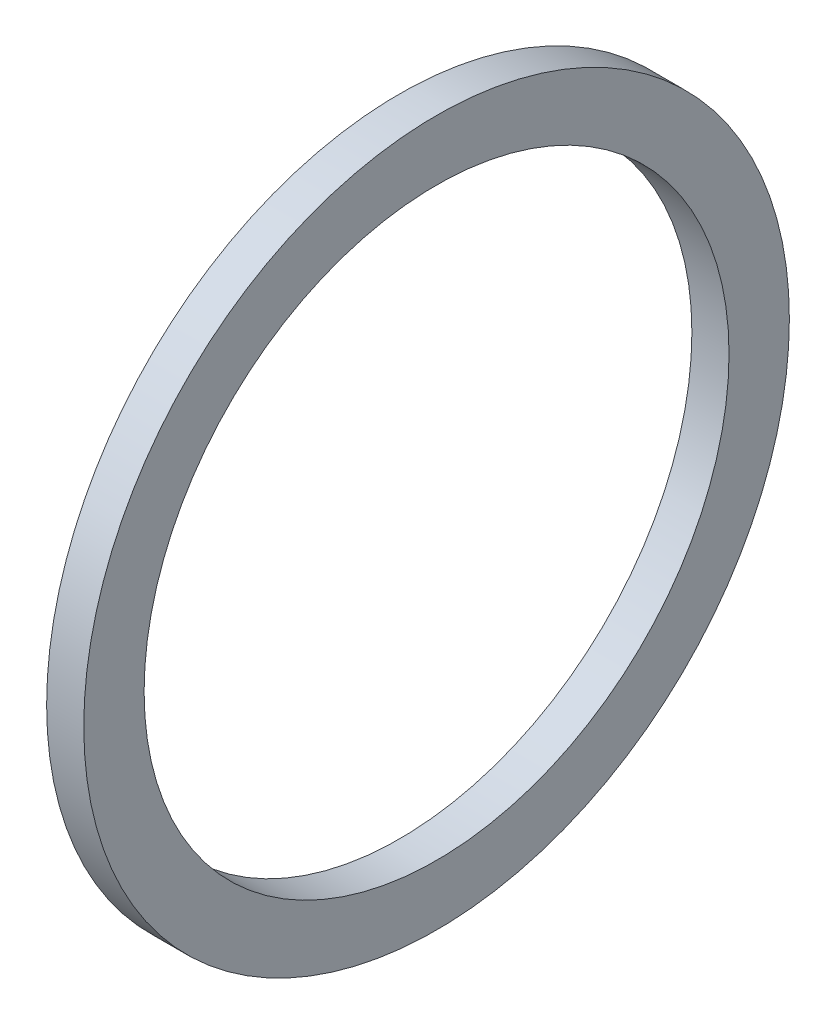
ISO-10303-21;
HEADER;
FILE_DESCRIPTION(('STEP AP214'),'2;1');
FILE_NAME('part.step','',(''),(''),'','','');
FILE_SCHEMA(('AUTOMOTIVE_DESIGN { 1 0 10303 214 1 1 1 1 }'));
ENDSEC;
DATA;
#1=APPLICATION_CONTEXT('core data for automotive mechanical design processes');
#2=APPLICATION_PROTOCOL_DEFINITION('international standard','automotive_design',2000,#1);
#3=PRODUCT_CONTEXT('',#1,'mechanical');
#4=PRODUCT('Part','Part','',(#3));
#5=PRODUCT_RELATED_PRODUCT_CATEGORY('part','',(#4));
#6=PRODUCT_DEFINITION_FORMATION('','',#4);
#7=PRODUCT_DEFINITION_CONTEXT('part definition',#1,'design');
#8=PRODUCT_DEFINITION('design','',#6,#7);
#9=PRODUCT_DEFINITION_SHAPE('','',#8);
#10=(LENGTH_UNIT() NAMED_UNIT(*) SI_UNIT(.MILLI.,.METRE.));
#11=(NAMED_UNIT(*) PLANE_ANGLE_UNIT() SI_UNIT($,.RADIAN.));
#12=(NAMED_UNIT(*) SI_UNIT($,.STERADIAN.) SOLID_ANGLE_UNIT());
#13=UNCERTAINTY_MEASURE_WITH_UNIT(LENGTH_MEASURE(1.E-05),#10,'distance_accuracy_value','');
#14=(GEOMETRIC_REPRESENTATION_CONTEXT(3) GLOBAL_UNCERTAINTY_ASSIGNED_CONTEXT((#13)) GLOBAL_UNIT_ASSIGNED_CONTEXT((#10,
#11,#12)) REPRESENTATION_CONTEXT('',''));
#15=CARTESIAN_POINT('',(0.,0.,0.));
#16=DIRECTION('',(0.,0.,1.));
#17=DIRECTION('',(1.,0.,0.));
#18=AXIS2_PLACEMENT_3D('',#15,#16,#17);
#19=CARTESIAN_POINT('',(0.,-16.002,0.));
#20=DIRECTION('',(-1.,0.,0.));
#21=DIRECTION('',(0.,0.,1.));
#22=AXIS2_PLACEMENT_3D('',#19,#20,#21);
#23=PLANE('',#22);
#24=CARTESIAN_POINT('',(0.,0.,0.));
#25=DIRECTION('',(-1.,0.,0.));
#26=DIRECTION('',(0.,0.,1.));
#27=AXIS2_PLACEMENT_3D('',#24,#25,#26);
#28=CIRCLE('',#27,19.304);
#29=CARTESIAN_POINT('',(0.,0.,19.304));
#30=VERTEX_POINT('',#29);
#31=EDGE_CURVE('E10',#30,#30,#28,.T.);
#32=ORIENTED_EDGE('',*,*,#31,.T.);
#33=EDGE_LOOP('',(#32));
#34=FACE_BOUND('',#33,.T.);
#35=CARTESIAN_POINT('',(0.,0.,0.));
#36=DIRECTION('',(-1.,0.,0.));
#37=DIRECTION('',(0.,0.,1.));
#38=AXIS2_PLACEMENT_3D('',#35,#36,#37);
#39=CIRCLE('',#38,16.002);
#40=CARTESIAN_POINT('',(0.,0.,16.002));
#41=VERTEX_POINT('',#40);
#42=EDGE_CURVE('E43',#41,#41,#39,.T.);
#43=ORIENTED_EDGE('',*,*,#42,.F.);
#44=EDGE_LOOP('',(#43));
#45=FACE_BOUND('',#44,.T.);
#46=ADVANCED_FACE('F29',(#34,#45),#23,.T.);
#47=CARTESIAN_POINT('',(-43.7165807560137,0.,0.));
#48=DIRECTION('',(-1.,0.,0.));
#49=DIRECTION('',(0.,0.,1.));
#50=AXIS2_PLACEMENT_3D('',#47,#48,#49);
#51=CYLINDRICAL_SURFACE('',#50,19.304);
#52=CARTESIAN_POINT('',(2.032,0.,0.));
#53=DIRECTION('',(-1.,0.,0.));
#54=DIRECTION('',(0.,0.,1.));
#55=AXIS2_PLACEMENT_3D('',#52,#53,#54);
#56=CIRCLE('',#55,19.304);
#57=CARTESIAN_POINT('',(2.032,0.,19.304));
#58=VERTEX_POINT('',#57);
#59=EDGE_CURVE('E35',#58,#58,#56,.T.);
#60=ORIENTED_EDGE('',*,*,#59,.T.);
#61=EDGE_LOOP('',(#60));
#62=FACE_BOUND('',#61,.T.);
#63=ORIENTED_EDGE('',*,*,#31,.F.);
#64=EDGE_LOOP('',(#63));
#65=FACE_BOUND('',#64,.T.);
#66=ADVANCED_FACE('F53',(#62,#65),#51,.T.);
#67=CARTESIAN_POINT('',(2.032,-16.002,0.));
#68=DIRECTION('',(1.,0.,0.));
#69=DIRECTION('',(0.,0.,-1.));
#70=AXIS2_PLACEMENT_3D('',#67,#68,#69);
#71=PLANE('',#70);
#72=CARTESIAN_POINT('',(2.032,0.,0.));
#73=DIRECTION('',(-1.,0.,0.));
#74=DIRECTION('',(0.,0.,1.));
#75=AXIS2_PLACEMENT_3D('',#72,#73,#74);
#76=CIRCLE('',#75,16.002);
#77=CARTESIAN_POINT('',(2.032,0.,16.002));
#78=VERTEX_POINT('',#77);
#79=EDGE_CURVE('E39',#78,#78,#76,.T.);
#80=ORIENTED_EDGE('',*,*,#79,.T.);
#81=EDGE_LOOP('',(#80));
#82=FACE_BOUND('',#81,.T.);
#83=ORIENTED_EDGE('',*,*,#59,.F.);
#84=EDGE_LOOP('',(#83));
#85=FACE_BOUND('',#84,.T.);
#86=ADVANCED_FACE('F57',(#82,#85),#71,.T.);
#87=CARTESIAN_POINT('',(-43.7165807560137,0.,0.));
#88=DIRECTION('',(-1.,0.,0.));
#89=DIRECTION('',(0.,0.,1.));
#90=AXIS2_PLACEMENT_3D('',#87,#88,#89);
#91=CYLINDRICAL_SURFACE('',#90,16.002);
#92=ORIENTED_EDGE('',*,*,#42,.T.);
#93=EDGE_LOOP('',(#92));
#94=FACE_BOUND('',#93,.T.);
#95=ORIENTED_EDGE('',*,*,#79,.F.);
#96=EDGE_LOOP('',(#95));
#97=FACE_BOUND('',#96,.T.);
#98=ADVANCED_FACE('F49',(#94,#97),#91,.F.);
#99=CLOSED_SHELL('',(#46,#66,#86,#98));
#100=MANIFOLD_SOLID_BREP('B2',#99);
#101=ADVANCED_BREP_SHAPE_REPRESENTATION('',(#18,#100),#14);
#102=SHAPE_DEFINITION_REPRESENTATION(#9,#101);
ENDSEC;
END-ISO-10303-21;
